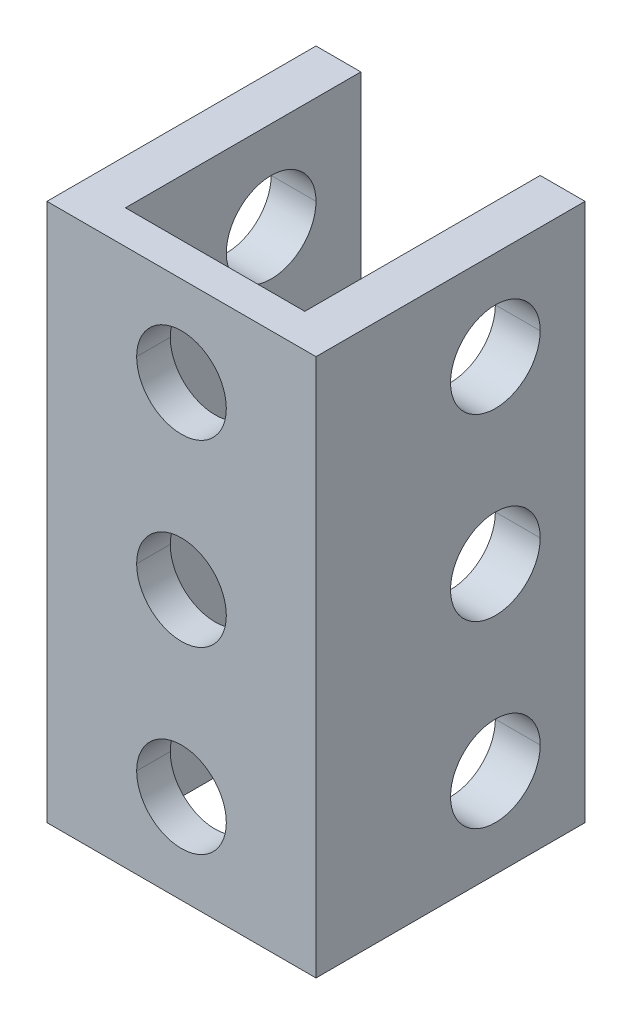
ISO-10303-21;
HEADER;
FILE_DESCRIPTION(('STEP AP214'),'2;1');
FILE_NAME('part.step','',(''),(''),'','','');
FILE_SCHEMA(('AUTOMOTIVE_DESIGN { 1 0 10303 214 1 1 1 1 }'));
ENDSEC;
DATA;
#1=APPLICATION_CONTEXT('core data for automotive mechanical design processes');
#2=APPLICATION_PROTOCOL_DEFINITION('international standard','automotive_design',2000,#1);
#3=PRODUCT_CONTEXT('',#1,'mechanical');
#4=PRODUCT('Part','Part','',(#3));
#5=PRODUCT_RELATED_PRODUCT_CATEGORY('part','',(#4));
#6=PRODUCT_DEFINITION_FORMATION('','',#4);
#7=PRODUCT_DEFINITION_CONTEXT('part definition',#1,'design');
#8=PRODUCT_DEFINITION('design','',#6,#7);
#9=PRODUCT_DEFINITION_SHAPE('','',#8);
#10=(LENGTH_UNIT() NAMED_UNIT(*) SI_UNIT(.MILLI.,.METRE.));
#11=(NAMED_UNIT(*) PLANE_ANGLE_UNIT() SI_UNIT($,.RADIAN.));
#12=(NAMED_UNIT(*) SI_UNIT($,.STERADIAN.) SOLID_ANGLE_UNIT());
#13=UNCERTAINTY_MEASURE_WITH_UNIT(LENGTH_MEASURE(1.E-05),#10,'distance_accuracy_value','');
#14=(GEOMETRIC_REPRESENTATION_CONTEXT(3) GLOBAL_UNCERTAINTY_ASSIGNED_CONTEXT((#13)) GLOBAL_UNIT_ASSIGNED_CONTEXT((#10,
#11,#12)) REPRESENTATION_CONTEXT('',''));
#15=CARTESIAN_POINT('',(0.,0.,0.));
#16=DIRECTION('',(0.,0.,1.));
#17=DIRECTION('',(1.,0.,0.));
#18=AXIS2_PLACEMENT_3D('',#15,#16,#17);
#19=CARTESIAN_POINT('',(0.,20.,1.5));
#20=DIRECTION('',(0.,0.,1.));
#21=DIRECTION('',(1.,0.,0.));
#22=AXIS2_PLACEMENT_3D('',#19,#20,#21);
#23=CYLINDRICAL_SURFACE('',#22,2.);
#24=DIRECTION('',(0.,0.,1.));
#25=VECTOR('',#24,1.);
#26=CARTESIAN_POINT('',(-2.,20.,1.5));
#27=LINE('',#26,#25);
#28=CARTESIAN_POINT('',(-2.,20.,0.));
#29=VERTEX_POINT('',#28);
#30=CARTESIAN_POINT('',(-2.,20.,1.5));
#31=VERTEX_POINT('',#30);
#32=EDGE_CURVE('E337',#29,#31,#27,.T.);
#33=ORIENTED_EDGE('',*,*,#32,.F.);
#34=CARTESIAN_POINT('',(0.,20.,0.));
#35=DIRECTION('',(0.,0.,1.));
#36=DIRECTION('',(1.,0.,0.));
#37=AXIS2_PLACEMENT_3D('',#34,#35,#36);
#38=CIRCLE('',#37,2.);
#39=CARTESIAN_POINT('',(2.,20.,0.));
#40=VERTEX_POINT('',#39);
#41=EDGE_CURVE('E310',#40,#29,#38,.T.);
#42=ORIENTED_EDGE('',*,*,#41,.F.);
#43=DIRECTION('',(0.,0.,1.));
#44=VECTOR('',#43,1.);
#45=CARTESIAN_POINT('',(2.,20.,1.5));
#46=LINE('',#45,#44);
#47=CARTESIAN_POINT('',(2.,20.,1.5));
#48=VERTEX_POINT('',#47);
#49=EDGE_CURVE('E336',#40,#48,#46,.T.);
#50=ORIENTED_EDGE('',*,*,#49,.T.);
#51=CARTESIAN_POINT('',(0.,20.,1.5));
#52=DIRECTION('',(0.,0.,1.));
#53=DIRECTION('',(1.,0.,0.));
#54=AXIS2_PLACEMENT_3D('',#51,#52,#53);
#55=CIRCLE('',#54,2.);
#56=EDGE_CURVE('E350',#48,#31,#55,.T.);
#57=ORIENTED_EDGE('',*,*,#56,.T.);
#58=EDGE_LOOP('',(#33,#42,#50,#57));
#59=FACE_BOUND('',#58,.T.);
#60=ADVANCED_FACE('F15',(#59),#23,.F.);
#61=CARTESIAN_POINT('',(0.,12.,1.5));
#62=DIRECTION('',(0.,0.,1.));
#63=DIRECTION('',(1.,0.,0.));
#64=AXIS2_PLACEMENT_3D('',#61,#62,#63);
#65=CYLINDRICAL_SURFACE('',#64,2.);
#66=DIRECTION('',(0.,0.,1.));
#67=VECTOR('',#66,1.);
#68=CARTESIAN_POINT('',(-2.,12.,1.5));
#69=LINE('',#68,#67);
#70=CARTESIAN_POINT('',(-2.,12.,0.));
#71=VERTEX_POINT('',#70);
#72=CARTESIAN_POINT('',(-2.,12.,1.5));
#73=VERTEX_POINT('',#72);
#74=EDGE_CURVE('E454',#71,#73,#69,.T.);
#75=ORIENTED_EDGE('',*,*,#74,.F.);
#76=CARTESIAN_POINT('',(0.,12.,0.));
#77=DIRECTION('',(0.,0.,1.));
#78=DIRECTION('',(1.,0.,0.));
#79=AXIS2_PLACEMENT_3D('',#76,#77,#78);
#80=CIRCLE('',#79,2.);
#81=CARTESIAN_POINT('',(2.,12.,0.));
#82=VERTEX_POINT('',#81);
#83=EDGE_CURVE('E19',#82,#71,#80,.T.);
#84=ORIENTED_EDGE('',*,*,#83,.F.);
#85=DIRECTION('',(0.,0.,1.));
#86=VECTOR('',#85,1.);
#87=CARTESIAN_POINT('',(2.,12.,1.5));
#88=LINE('',#87,#86);
#89=CARTESIAN_POINT('',(2.,12.,1.5));
#90=VERTEX_POINT('',#89);
#91=EDGE_CURVE('E465',#82,#90,#88,.T.);
#92=ORIENTED_EDGE('',*,*,#91,.T.);
#93=CARTESIAN_POINT('',(0.,12.,1.5));
#94=DIRECTION('',(0.,0.,1.));
#95=DIRECTION('',(1.,0.,0.));
#96=AXIS2_PLACEMENT_3D('',#93,#94,#95);
#97=CIRCLE('',#96,2.);
#98=EDGE_CURVE('E246',#90,#73,#97,.T.);
#99=ORIENTED_EDGE('',*,*,#98,.T.);
#100=EDGE_LOOP('',(#75,#84,#92,#99));
#101=FACE_BOUND('',#100,.T.);
#102=ADVANCED_FACE('F569',(#101),#65,.F.);
#103=CARTESIAN_POINT('',(-6.,20.,-6.5));
#104=DIRECTION('',(-1.,0.,0.));
#105=DIRECTION('',(0.,0.,1.));
#106=AXIS2_PLACEMENT_3D('',#103,#104,#105);
#107=CYLINDRICAL_SURFACE('',#106,2.);
#108=DIRECTION('',(-1.,0.,0.));
#109=VECTOR('',#108,1.);
#110=CARTESIAN_POINT('',(-6.,20.,-8.5));
#111=LINE('',#110,#109);
#112=CARTESIAN_POINT('',(6.,20.,-8.5));
#113=VERTEX_POINT('',#112);
#114=CARTESIAN_POINT('',(4.,20.,-8.5));
#115=VERTEX_POINT('',#114);
#116=EDGE_CURVE('E455',#113,#115,#111,.T.);
#117=ORIENTED_EDGE('',*,*,#116,.F.);
#118=CARTESIAN_POINT('',(6.,20.,-6.5));
#119=DIRECTION('',(-1.,0.,0.));
#120=DIRECTION('',(0.,0.,1.));
#121=AXIS2_PLACEMENT_3D('',#118,#119,#120);
#122=CIRCLE('',#121,2.);
#123=CARTESIAN_POINT('',(6.,20.,-4.5));
#124=VERTEX_POINT('',#123);
#125=EDGE_CURVE('E281',#124,#113,#122,.T.);
#126=ORIENTED_EDGE('',*,*,#125,.F.);
#127=DIRECTION('',(-1.,0.,0.));
#128=VECTOR('',#127,1.);
#129=CARTESIAN_POINT('',(-6.,20.,-4.5));
#130=LINE('',#129,#128);
#131=CARTESIAN_POINT('',(4.,20.,-4.5));
#132=VERTEX_POINT('',#131);
#133=EDGE_CURVE('E317',#124,#132,#130,.T.);
#134=ORIENTED_EDGE('',*,*,#133,.T.);
#135=CARTESIAN_POINT('',(4.,20.,-6.5));
#136=DIRECTION('',(1.,0.,0.));
#137=DIRECTION('',(0.,0.,-1.));
#138=AXIS2_PLACEMENT_3D('',#135,#136,#137);
#139=CIRCLE('',#138,2.);
#140=EDGE_CURVE('E341',#115,#132,#139,.T.);
#141=ORIENTED_EDGE('',*,*,#140,.F.);
#142=EDGE_LOOP('',(#117,#126,#134,#141));
#143=FACE_BOUND('',#142,.T.);
#144=ADVANCED_FACE('F565',(#143),#107,.F.);
#145=CARTESIAN_POINT('',(-6.,12.,-6.5));
#146=DIRECTION('',(-1.,0.,0.));
#147=DIRECTION('',(0.,0.,1.));
#148=AXIS2_PLACEMENT_3D('',#145,#146,#147);
#149=CYLINDRICAL_SURFACE('',#148,2.);
#150=DIRECTION('',(-1.,0.,0.));
#151=VECTOR('',#150,1.);
#152=CARTESIAN_POINT('',(-6.,12.,-8.5));
#153=LINE('',#152,#151);
#154=CARTESIAN_POINT('',(6.,12.,-8.5));
#155=VERTEX_POINT('',#154);
#156=CARTESIAN_POINT('',(4.,12.,-8.5));
#157=VERTEX_POINT('',#156);
#158=EDGE_CURVE('E292',#155,#157,#153,.T.);
#159=ORIENTED_EDGE('',*,*,#158,.F.);
#160=CARTESIAN_POINT('',(6.,12.,-6.5));
#161=DIRECTION('',(-1.,0.,0.));
#162=DIRECTION('',(0.,0.,1.));
#163=AXIS2_PLACEMENT_3D('',#160,#161,#162);
#164=CIRCLE('',#163,2.);
#165=CARTESIAN_POINT('',(6.,12.,-4.5));
#166=VERTEX_POINT('',#165);
#167=EDGE_CURVE('E316',#166,#155,#164,.T.);
#168=ORIENTED_EDGE('',*,*,#167,.F.);
#169=DIRECTION('',(-1.,0.,0.));
#170=VECTOR('',#169,1.);
#171=CARTESIAN_POINT('',(-6.,12.,-4.5));
#172=LINE('',#171,#170);
#173=CARTESIAN_POINT('',(4.,12.,-4.5));
#174=VERTEX_POINT('',#173);
#175=EDGE_CURVE('E354',#166,#174,#172,.T.);
#176=ORIENTED_EDGE('',*,*,#175,.T.);
#177=CARTESIAN_POINT('',(4.,12.,-6.5));
#178=DIRECTION('',(1.,0.,0.));
#179=DIRECTION('',(0.,0.,-1.));
#180=AXIS2_PLACEMENT_3D('',#177,#178,#179);
#181=CIRCLE('',#180,2.);
#182=EDGE_CURVE('E342',#157,#174,#181,.T.);
#183=ORIENTED_EDGE('',*,*,#182,.F.);
#184=EDGE_LOOP('',(#159,#168,#176,#183));
#185=FACE_BOUND('',#184,.T.);
#186=ADVANCED_FACE('F557',(#185),#149,.F.);
#187=CARTESIAN_POINT('',(-6.,20.,-6.5));
#188=DIRECTION('',(-1.,0.,0.));
#189=DIRECTION('',(0.,0.,1.));
#190=AXIS2_PLACEMENT_3D('',#187,#188,#189);
#191=CYLINDRICAL_SURFACE('',#190,2.);
#192=DIRECTION('',(-1.,0.,0.));
#193=VECTOR('',#192,1.);
#194=CARTESIAN_POINT('',(-6.,20.,-8.5));
#195=LINE('',#194,#193);
#196=CARTESIAN_POINT('',(-4.,20.,-8.5));
#197=VERTEX_POINT('',#196);
#198=CARTESIAN_POINT('',(-6.,20.,-8.5));
#199=VERTEX_POINT('',#198);
#200=EDGE_CURVE('E298',#197,#199,#195,.T.);
#201=ORIENTED_EDGE('',*,*,#200,.F.);
#202=CARTESIAN_POINT('',(-4.,20.,-6.5));
#203=DIRECTION('',(-1.,0.,0.));
#204=DIRECTION('',(0.,0.,1.));
#205=AXIS2_PLACEMENT_3D('',#202,#203,#204);
#206=CIRCLE('',#205,2.);
#207=CARTESIAN_POINT('',(-4.,20.,-4.5));
#208=VERTEX_POINT('',#207);
#209=EDGE_CURVE('E272',#208,#197,#206,.T.);
#210=ORIENTED_EDGE('',*,*,#209,.F.);
#211=DIRECTION('',(-1.,0.,0.));
#212=VECTOR('',#211,1.);
#213=CARTESIAN_POINT('',(-6.,20.,-4.5));
#214=LINE('',#213,#212);
#215=CARTESIAN_POINT('',(-6.,20.,-4.5));
#216=VERTEX_POINT('',#215);
#217=EDGE_CURVE('E343',#208,#216,#214,.T.);
#218=ORIENTED_EDGE('',*,*,#217,.T.);
#219=CARTESIAN_POINT('',(-6.,20.,-6.5));
#220=DIRECTION('',(-1.,0.,0.));
#221=DIRECTION('',(0.,0.,1.));
#222=AXIS2_PLACEMENT_3D('',#219,#220,#221);
#223=CIRCLE('',#222,2.);
#224=EDGE_CURVE('E384',#216,#199,#223,.T.);
#225=ORIENTED_EDGE('',*,*,#224,.T.);
#226=EDGE_LOOP('',(#201,#210,#218,#225));
#227=FACE_BOUND('',#226,.T.);
#228=ADVANCED_FACE('F17',(#227),#191,.F.);
#229=CARTESIAN_POINT('',(-6.,12.,-6.5));
#230=DIRECTION('',(-1.,0.,0.));
#231=DIRECTION('',(0.,0.,1.));
#232=AXIS2_PLACEMENT_3D('',#229,#230,#231);
#233=CYLINDRICAL_SURFACE('',#232,2.);
#234=DIRECTION('',(-1.,0.,0.));
#235=VECTOR('',#234,1.);
#236=CARTESIAN_POINT('',(-6.,12.,-8.5));
#237=LINE('',#236,#235);
#238=CARTESIAN_POINT('',(-4.,12.,-8.5));
#239=VERTEX_POINT('',#238);
#240=CARTESIAN_POINT('',(-6.,12.,-8.5));
#241=VERTEX_POINT('',#240);
#242=EDGE_CURVE('E363',#239,#241,#237,.T.);
#243=ORIENTED_EDGE('',*,*,#242,.F.);
#244=CARTESIAN_POINT('',(-4.,12.,-6.5));
#245=DIRECTION('',(-1.,0.,0.));
#246=DIRECTION('',(0.,0.,1.));
#247=AXIS2_PLACEMENT_3D('',#244,#245,#246);
#248=CIRCLE('',#247,2.);
#249=CARTESIAN_POINT('',(-4.,12.,-4.5));
#250=VERTEX_POINT('',#249);
#251=EDGE_CURVE('E208',#250,#239,#248,.T.);
#252=ORIENTED_EDGE('',*,*,#251,.F.);
#253=DIRECTION('',(-1.,0.,0.));
#254=VECTOR('',#253,1.);
#255=CARTESIAN_POINT('',(-6.,12.,-4.5));
#256=LINE('',#255,#254);
#257=CARTESIAN_POINT('',(-6.,12.,-4.5));
#258=VERTEX_POINT('',#257);
#259=EDGE_CURVE('E324',#250,#258,#256,.T.);
#260=ORIENTED_EDGE('',*,*,#259,.T.);
#261=CARTESIAN_POINT('',(-6.,12.,-6.5));
#262=DIRECTION('',(-1.,0.,0.));
#263=DIRECTION('',(0.,0.,1.));
#264=AXIS2_PLACEMENT_3D('',#261,#262,#263);
#265=CIRCLE('',#264,2.);
#266=EDGE_CURVE('E217',#258,#241,#265,.T.);
#267=ORIENTED_EDGE('',*,*,#266,.T.);
#268=EDGE_LOOP('',(#243,#252,#260,#267));
#269=FACE_BOUND('',#268,.T.);
#270=ADVANCED_FACE('F556',(#269),#233,.F.);
#271=CARTESIAN_POINT('',(0.,24.,0.));
#272=DIRECTION('',(0.,1.,0.));
#273=DIRECTION('',(1.,0.,0.));
#274=AXIS2_PLACEMENT_3D('',#271,#272,#273);
#275=PLANE('',#274);
#276=DIRECTION('',(0.,0.,-1.));
#277=VECTOR('',#276,1.);
#278=CARTESIAN_POINT('',(-4.,24.,0.));
#279=LINE('',#278,#277);
#280=CARTESIAN_POINT('',(-4.,24.,0.));
#281=VERTEX_POINT('',#280);
#282=CARTESIAN_POINT('',(-4.,24.,-10.5));
#283=VERTEX_POINT('',#282);
#284=EDGE_CURVE('E286',#281,#283,#279,.T.);
#285=ORIENTED_EDGE('',*,*,#284,.T.);
#286=DIRECTION('',(-1.,0.,0.));
#287=VECTOR('',#286,1.);
#288=CARTESIAN_POINT('',(-4.,24.,-10.5));
#289=LINE('',#288,#287);
#290=CARTESIAN_POINT('',(-6.,24.,-10.5));
#291=VERTEX_POINT('',#290);
#292=EDGE_CURVE('E409',#283,#291,#289,.T.);
#293=ORIENTED_EDGE('',*,*,#292,.T.);
#294=DIRECTION('',(0.,0.,1.));
#295=VECTOR('',#294,1.);
#296=CARTESIAN_POINT('',(-6.,24.,-10.5));
#297=LINE('',#296,#295);
#298=CARTESIAN_POINT('',(-6.,24.,1.5));
#299=VERTEX_POINT('',#298);
#300=EDGE_CURVE('E420',#291,#299,#297,.T.);
#301=ORIENTED_EDGE('',*,*,#300,.T.);
#302=DIRECTION('',(1.,0.,0.));
#303=VECTOR('',#302,1.);
#304=CARTESIAN_POINT('',(-6.,24.,1.5));
#305=LINE('',#304,#303);
#306=CARTESIAN_POINT('',(6.,24.,1.5));
#307=VERTEX_POINT('',#306);
#308=EDGE_CURVE('E393',#299,#307,#305,.T.);
#309=ORIENTED_EDGE('',*,*,#308,.T.);
#310=DIRECTION('',(0.,0.,-1.));
#311=VECTOR('',#310,1.);
#312=CARTESIAN_POINT('',(6.,24.,-10.5));
#313=LINE('',#312,#311);
#314=CARTESIAN_POINT('',(6.,24.,-10.5));
#315=VERTEX_POINT('',#314);
#316=EDGE_CURVE('E325',#307,#315,#313,.T.);
#317=ORIENTED_EDGE('',*,*,#316,.T.);
#318=DIRECTION('',(-1.,0.,0.));
#319=VECTOR('',#318,1.);
#320=CARTESIAN_POINT('',(4.,24.,-10.5));
#321=LINE('',#320,#319);
#322=CARTESIAN_POINT('',(4.,24.,-10.5));
#323=VERTEX_POINT('',#322);
#324=EDGE_CURVE('E428',#315,#323,#321,.T.);
#325=ORIENTED_EDGE('',*,*,#324,.T.);
#326=DIRECTION('',(0.,0.,1.));
#327=VECTOR('',#326,1.);
#328=CARTESIAN_POINT('',(4.,24.,0.));
#329=LINE('',#328,#327);
#330=CARTESIAN_POINT('',(4.,24.,0.));
#331=VERTEX_POINT('',#330);
#332=EDGE_CURVE('E374',#323,#331,#329,.T.);
#333=ORIENTED_EDGE('',*,*,#332,.T.);
#334=DIRECTION('',(-1.,0.,0.));
#335=VECTOR('',#334,1.);
#336=CARTESIAN_POINT('',(4.,24.,0.));
#337=LINE('',#336,#335);
#338=EDGE_CURVE('E40',#331,#281,#337,.T.);
#339=ORIENTED_EDGE('',*,*,#338,.T.);
#340=EDGE_LOOP('',(#285,#293,#301,#309,#317,#325,#333,#339));
#341=FACE_BOUND('',#340,.T.);
#342=ADVANCED_FACE('F563',(#341),#275,.T.);
#343=CARTESIAN_POINT('',(0.,4.,1.5));
#344=DIRECTION('',(0.,0.,1.));
#345=DIRECTION('',(1.,0.,0.));
#346=AXIS2_PLACEMENT_3D('',#343,#344,#345);
#347=CYLINDRICAL_SURFACE('',#346,2.);
#348=DIRECTION('',(0.,0.,1.));
#349=VECTOR('',#348,1.);
#350=CARTESIAN_POINT('',(-2.,4.,1.5));
#351=LINE('',#350,#349);
#352=CARTESIAN_POINT('',(-2.,4.,0.));
#353=VERTEX_POINT('',#352);
#354=CARTESIAN_POINT('',(-2.,4.,1.5));
#355=VERTEX_POINT('',#354);
#356=EDGE_CURVE('E258',#353,#355,#351,.T.);
#357=ORIENTED_EDGE('',*,*,#356,.F.);
#358=CARTESIAN_POINT('',(0.,4.,0.));
#359=DIRECTION('',(0.,0.,1.));
#360=DIRECTION('',(1.,0.,0.));
#361=AXIS2_PLACEMENT_3D('',#358,#359,#360);
#362=CIRCLE('',#361,2.);
#363=CARTESIAN_POINT('',(2.,4.,0.));
#364=VERTEX_POINT('',#363);
#365=EDGE_CURVE('E10',#364,#353,#362,.T.);
#366=ORIENTED_EDGE('',*,*,#365,.F.);
#367=DIRECTION('',(0.,0.,1.));
#368=VECTOR('',#367,1.);
#369=CARTESIAN_POINT('',(2.,4.,1.5));
#370=LINE('',#369,#368);
#371=CARTESIAN_POINT('',(2.,4.,1.5));
#372=VERTEX_POINT('',#371);
#373=EDGE_CURVE('E249',#364,#372,#370,.T.);
#374=ORIENTED_EDGE('',*,*,#373,.T.);
#375=CARTESIAN_POINT('',(0.,4.,1.5));
#376=DIRECTION('',(0.,0.,1.));
#377=DIRECTION('',(1.,0.,0.));
#378=AXIS2_PLACEMENT_3D('',#375,#376,#377);
#379=CIRCLE('',#378,2.);
#380=EDGE_CURVE('E235',#372,#355,#379,.T.);
#381=ORIENTED_EDGE('',*,*,#380,.T.);
#382=EDGE_LOOP('',(#357,#366,#374,#381));
#383=FACE_BOUND('',#382,.T.);
#384=ADVANCED_FACE('F250',(#383),#347,.F.);
#385=CARTESIAN_POINT('',(-6.,4.,-6.5));
#386=DIRECTION('',(-1.,0.,0.));
#387=DIRECTION('',(0.,0.,1.));
#388=AXIS2_PLACEMENT_3D('',#385,#386,#387);
#389=CYLINDRICAL_SURFACE('',#388,2.);
#390=DIRECTION('',(-1.,0.,0.));
#391=VECTOR('',#390,1.);
#392=CARTESIAN_POINT('',(-6.,4.,-8.5));
#393=LINE('',#392,#391);
#394=CARTESIAN_POINT('',(-4.,4.,-8.5));
#395=VERTEX_POINT('',#394);
#396=CARTESIAN_POINT('',(-6.,4.,-8.5));
#397=VERTEX_POINT('',#396);
#398=EDGE_CURVE('E359',#395,#397,#393,.T.);
#399=ORIENTED_EDGE('',*,*,#398,.F.);
#400=CARTESIAN_POINT('',(-4.,4.,-6.5));
#401=DIRECTION('',(-1.,0.,0.));
#402=DIRECTION('',(0.,0.,1.));
#403=AXIS2_PLACEMENT_3D('',#400,#401,#402);
#404=CIRCLE('',#403,2.);
#405=CARTESIAN_POINT('',(-4.,4.,-4.5));
#406=VERTEX_POINT('',#405);
#407=EDGE_CURVE('E275',#406,#395,#404,.T.);
#408=ORIENTED_EDGE('',*,*,#407,.F.);
#409=DIRECTION('',(-1.,0.,0.));
#410=VECTOR('',#409,1.);
#411=CARTESIAN_POINT('',(-6.,4.,-4.5));
#412=LINE('',#411,#410);
#413=CARTESIAN_POINT('',(-6.,4.,-4.5));
#414=VERTEX_POINT('',#413);
#415=EDGE_CURVE('E309',#406,#414,#412,.T.);
#416=ORIENTED_EDGE('',*,*,#415,.T.);
#417=CARTESIAN_POINT('',(-6.,4.,-6.5));
#418=DIRECTION('',(-1.,0.,0.));
#419=DIRECTION('',(0.,0.,1.));
#420=AXIS2_PLACEMENT_3D('',#417,#418,#419);
#421=CIRCLE('',#420,2.);
#422=EDGE_CURVE('E396',#414,#397,#421,.T.);
#423=ORIENTED_EDGE('',*,*,#422,.T.);
#424=EDGE_LOOP('',(#399,#408,#416,#423));
#425=FACE_BOUND('',#424,.T.);
#426=ADVANCED_FACE('F792',(#425),#389,.F.);
#427=CARTESIAN_POINT('',(-6.,4.,-6.5));
#428=DIRECTION('',(-1.,0.,0.));
#429=DIRECTION('',(0.,0.,1.));
#430=AXIS2_PLACEMENT_3D('',#427,#428,#429);
#431=CYLINDRICAL_SURFACE('',#430,2.);
#432=DIRECTION('',(-1.,0.,0.));
#433=VECTOR('',#432,1.);
#434=CARTESIAN_POINT('',(-6.,4.,-8.5));
#435=LINE('',#434,#433);
#436=CARTESIAN_POINT('',(6.,4.,-8.5));
#437=VERTEX_POINT('',#436);
#438=CARTESIAN_POINT('',(4.,4.,-8.5));
#439=VERTEX_POINT('',#438);
#440=EDGE_CURVE('E308',#437,#439,#435,.T.);
#441=ORIENTED_EDGE('',*,*,#440,.F.);
#442=CARTESIAN_POINT('',(6.,4.,-6.5));
#443=DIRECTION('',(-1.,0.,0.));
#444=DIRECTION('',(0.,0.,1.));
#445=AXIS2_PLACEMENT_3D('',#442,#443,#444);
#446=CIRCLE('',#445,2.);
#447=CARTESIAN_POINT('',(6.,4.,-4.5));
#448=VERTEX_POINT('',#447);
#449=EDGE_CURVE('E313',#448,#437,#446,.T.);
#450=ORIENTED_EDGE('',*,*,#449,.F.);
#451=DIRECTION('',(-1.,0.,0.));
#452=VECTOR('',#451,1.);
#453=CARTESIAN_POINT('',(-6.,4.,-4.5));
#454=LINE('',#453,#452);
#455=CARTESIAN_POINT('',(4.,4.,-4.5));
#456=VERTEX_POINT('',#455);
#457=EDGE_CURVE('E270',#448,#456,#454,.T.);
#458=ORIENTED_EDGE('',*,*,#457,.T.);
#459=CARTESIAN_POINT('',(4.,4.,-6.5));
#460=DIRECTION('',(1.,0.,0.));
#461=DIRECTION('',(0.,0.,-1.));
#462=AXIS2_PLACEMENT_3D('',#459,#460,#461);
#463=CIRCLE('',#462,2.);
#464=EDGE_CURVE('E338',#439,#456,#463,.T.);
#465=ORIENTED_EDGE('',*,*,#464,.F.);
#466=EDGE_LOOP('',(#441,#450,#458,#465));
#467=FACE_BOUND('',#466,.T.);
#468=ADVANCED_FACE('F796',(#467),#431,.F.);
#469=CARTESIAN_POINT('',(0.,0.,0.));
#470=DIRECTION('',(0.,1.,0.));
#471=DIRECTION('',(1.,0.,0.));
#472=AXIS2_PLACEMENT_3D('',#469,#470,#471);
#473=PLANE('',#472);
#474=DIRECTION('',(0.,0.,-1.));
#475=VECTOR('',#474,1.);
#476=CARTESIAN_POINT('',(-4.,0.,0.));
#477=LINE('',#476,#475);
#478=CARTESIAN_POINT('',(-4.,0.,0.));
#479=VERTEX_POINT('',#478);
#480=CARTESIAN_POINT('',(-4.,0.,-10.5));
#481=VERTEX_POINT('',#480);
#482=EDGE_CURVE('E287',#479,#481,#477,.T.);
#483=ORIENTED_EDGE('',*,*,#482,.F.);
#484=DIRECTION('',(-1.,0.,0.));
#485=VECTOR('',#484,1.);
#486=CARTESIAN_POINT('',(4.,0.,0.));
#487=LINE('',#486,#485);
#488=CARTESIAN_POINT('',(4.,0.,0.));
#489=VERTEX_POINT('',#488);
#490=EDGE_CURVE('E416',#489,#479,#487,.T.);
#491=ORIENTED_EDGE('',*,*,#490,.F.);
#492=DIRECTION('',(0.,0.,1.));
#493=VECTOR('',#492,1.);
#494=CARTESIAN_POINT('',(4.,0.,0.));
#495=LINE('',#494,#493);
#496=CARTESIAN_POINT('',(4.,0.,-10.5));
#497=VERTEX_POINT('',#496);
#498=EDGE_CURVE('E422',#497,#489,#495,.T.);
#499=ORIENTED_EDGE('',*,*,#498,.F.);
#500=DIRECTION('',(-1.,0.,0.));
#501=VECTOR('',#500,1.);
#502=CARTESIAN_POINT('',(4.,0.,-10.5));
#503=LINE('',#502,#501);
#504=CARTESIAN_POINT('',(6.,0.,-10.5));
#505=VERTEX_POINT('',#504);
#506=EDGE_CURVE('E276',#505,#497,#503,.T.);
#507=ORIENTED_EDGE('',*,*,#506,.F.);
#508=DIRECTION('',(0.,0.,-1.));
#509=VECTOR('',#508,1.);
#510=CARTESIAN_POINT('',(6.,0.,-10.5));
#511=LINE('',#510,#509);
#512=CARTESIAN_POINT('',(6.,0.,1.5));
#513=VERTEX_POINT('',#512);
#514=EDGE_CURVE('E245',#513,#505,#511,.T.);
#515=ORIENTED_EDGE('',*,*,#514,.F.);
#516=DIRECTION('',(1.,0.,0.));
#517=VECTOR('',#516,1.);
#518=CARTESIAN_POINT('',(-6.,0.,1.5));
#519=LINE('',#518,#517);
#520=CARTESIAN_POINT('',(-6.,0.,1.5));
#521=VERTEX_POINT('',#520);
#522=EDGE_CURVE('E380',#521,#513,#519,.T.);
#523=ORIENTED_EDGE('',*,*,#522,.F.);
#524=DIRECTION('',(0.,0.,1.));
#525=VECTOR('',#524,1.);
#526=CARTESIAN_POINT('',(-6.,0.,-10.5));
#527=LINE('',#526,#525);
#528=CARTESIAN_POINT('',(-6.,0.,-10.5));
#529=VERTEX_POINT('',#528);
#530=EDGE_CURVE('E441',#529,#521,#527,.T.);
#531=ORIENTED_EDGE('',*,*,#530,.F.);
#532=DIRECTION('',(-1.,0.,0.));
#533=VECTOR('',#532,1.);
#534=CARTESIAN_POINT('',(-4.,0.,-10.5));
#535=LINE('',#534,#533);
#536=EDGE_CURVE('E274',#481,#529,#535,.T.);
#537=ORIENTED_EDGE('',*,*,#536,.F.);
#538=EDGE_LOOP('',(#483,#491,#499,#507,#515,#523,#531,#537));
#539=FACE_BOUND('',#538,.T.);
#540=ADVANCED_FACE('F592',(#539),#473,.F.);
#541=CARTESIAN_POINT('',(4.,8.,0.));
#542=DIRECTION('',(0.,0.,1.));
#543=DIRECTION('',(1.,0.,0.));
#544=AXIS2_PLACEMENT_3D('',#541,#542,#543);
#545=PLANE('',#544);
#546=ORIENTED_EDGE('',*,*,#365,.T.);
#547=CARTESIAN_POINT('',(0.,4.,0.));
#548=DIRECTION('',(0.,0.,1.));
#549=DIRECTION('',(1.,0.,0.));
#550=AXIS2_PLACEMENT_3D('',#547,#548,#549);
#551=CIRCLE('',#550,2.);
#552=EDGE_CURVE('E266',#353,#364,#551,.T.);
#553=ORIENTED_EDGE('',*,*,#552,.T.);
#554=EDGE_LOOP('',(#546,#553));
#555=FACE_BOUND('',#554,.T.);
#556=ORIENTED_EDGE('',*,*,#83,.T.);
#557=CARTESIAN_POINT('',(0.,12.,0.));
#558=DIRECTION('',(0.,0.,1.));
#559=DIRECTION('',(1.,0.,0.));
#560=AXIS2_PLACEMENT_3D('',#557,#558,#559);
#561=CIRCLE('',#560,2.);
#562=EDGE_CURVE('E450',#71,#82,#561,.T.);
#563=ORIENTED_EDGE('',*,*,#562,.T.);
#564=EDGE_LOOP('',(#556,#563));
#565=FACE_BOUND('',#564,.T.);
#566=ORIENTED_EDGE('',*,*,#41,.T.);
#567=CARTESIAN_POINT('',(0.,20.,0.));
#568=DIRECTION('',(0.,0.,1.));
#569=DIRECTION('',(1.,0.,0.));
#570=AXIS2_PLACEMENT_3D('',#567,#568,#569);
#571=CIRCLE('',#570,2.);
#572=EDGE_CURVE('E504',#29,#40,#571,.T.);
#573=ORIENTED_EDGE('',*,*,#572,.T.);
#574=EDGE_LOOP('',(#566,#573));
#575=FACE_BOUND('',#574,.T.);
#576=ORIENTED_EDGE('',*,*,#490,.T.);
#577=DIRECTION('',(0.,-1.,0.));
#578=VECTOR('',#577,1.);
#579=CARTESIAN_POINT('',(-4.,8.,0.));
#580=LINE('',#579,#578);
#581=EDGE_CURVE('E370',#281,#479,#580,.T.);
#582=ORIENTED_EDGE('',*,*,#581,.F.);
#583=ORIENTED_EDGE('',*,*,#338,.F.);
#584=DIRECTION('',(0.,-1.,0.));
#585=VECTOR('',#584,1.);
#586=CARTESIAN_POINT('',(4.,8.,0.));
#587=LINE('',#586,#585);
#588=EDGE_CURVE('E377',#331,#489,#587,.T.);
#589=ORIENTED_EDGE('',*,*,#588,.T.);
#590=EDGE_LOOP('',(#576,#582,#583,#589));
#591=FACE_BOUND('',#590,.T.);
#592=ADVANCED_FACE('F588',(#555,#565,#575,#591),#545,.F.);
#593=CARTESIAN_POINT('',(4.,8.,0.));
#594=DIRECTION('',(1.,0.,0.));
#595=DIRECTION('',(0.,1.,0.));
#596=AXIS2_PLACEMENT_3D('',#593,#594,#595);
#597=PLANE('',#596);
#598=CARTESIAN_POINT('',(4.,20.,-6.5));
#599=DIRECTION('',(1.,0.,0.));
#600=DIRECTION('',(0.,0.,-1.));
#601=AXIS2_PLACEMENT_3D('',#598,#599,#600);
#602=CIRCLE('',#601,2.);
#603=EDGE_CURVE('E321',#132,#115,#602,.T.);
#604=ORIENTED_EDGE('',*,*,#603,.T.);
#605=ORIENTED_EDGE('',*,*,#140,.T.);
#606=EDGE_LOOP('',(#604,#605));
#607=FACE_BOUND('',#606,.T.);
#608=CARTESIAN_POINT('',(4.,4.,-6.5));
#609=DIRECTION('',(1.,0.,0.));
#610=DIRECTION('',(0.,0.,-1.));
#611=AXIS2_PLACEMENT_3D('',#608,#609,#610);
#612=CIRCLE('',#611,2.);
#613=EDGE_CURVE('E482',#456,#439,#612,.T.);
#614=ORIENTED_EDGE('',*,*,#613,.T.);
#615=ORIENTED_EDGE('',*,*,#464,.T.);
#616=EDGE_LOOP('',(#614,#615));
#617=FACE_BOUND('',#616,.T.);
#618=CARTESIAN_POINT('',(4.,12.,-6.5));
#619=DIRECTION('',(1.,0.,0.));
#620=DIRECTION('',(0.,0.,-1.));
#621=AXIS2_PLACEMENT_3D('',#618,#619,#620);
#622=CIRCLE('',#621,2.);
#623=EDGE_CURVE('E296',#174,#157,#622,.T.);
#624=ORIENTED_EDGE('',*,*,#623,.T.);
#625=ORIENTED_EDGE('',*,*,#182,.T.);
#626=EDGE_LOOP('',(#624,#625));
#627=FACE_BOUND('',#626,.T.);
#628=ORIENTED_EDGE('',*,*,#498,.T.);
#629=ORIENTED_EDGE('',*,*,#588,.F.);
#630=ORIENTED_EDGE('',*,*,#332,.F.);
#631=DIRECTION('',(0.,-1.,0.));
#632=VECTOR('',#631,1.);
#633=CARTESIAN_POINT('',(4.,8.,-10.5));
#634=LINE('',#633,#632);
#635=EDGE_CURVE('E280',#323,#497,#634,.T.);
#636=ORIENTED_EDGE('',*,*,#635,.T.);
#637=EDGE_LOOP('',(#628,#629,#630,#636));
#638=FACE_BOUND('',#637,.T.);
#639=ADVANCED_FACE('F591',(#607,#617,#627,#638),#597,.F.);
#640=CARTESIAN_POINT('',(4.,8.,-10.5));
#641=DIRECTION('',(0.,0.,1.));
#642=DIRECTION('',(1.,0.,0.));
#643=AXIS2_PLACEMENT_3D('',#640,#641,#642);
#644=PLANE('',#643);
#645=ORIENTED_EDGE('',*,*,#506,.T.);
#646=ORIENTED_EDGE('',*,*,#635,.F.);
#647=ORIENTED_EDGE('',*,*,#324,.F.);
#648=DIRECTION('',(0.,-1.,0.));
#649=VECTOR('',#648,1.);
#650=CARTESIAN_POINT('',(6.,8.,-10.5));
#651=LINE('',#650,#649);
#652=EDGE_CURVE('E329',#315,#505,#651,.T.);
#653=ORIENTED_EDGE('',*,*,#652,.T.);
#654=EDGE_LOOP('',(#645,#646,#647,#653));
#655=FACE_BOUND('',#654,.T.);
#656=ADVANCED_FACE('F611',(#655),#644,.F.);
#657=CARTESIAN_POINT('',(6.,8.,-10.5));
#658=DIRECTION('',(-1.,0.,0.));
#659=DIRECTION('',(0.,0.,1.));
#660=AXIS2_PLACEMENT_3D('',#657,#658,#659);
#661=PLANE('',#660);
#662=ORIENTED_EDGE('',*,*,#125,.T.);
#663=CARTESIAN_POINT('',(6.,20.,-6.5));
#664=DIRECTION('',(-1.,0.,0.));
#665=DIRECTION('',(0.,0.,1.));
#666=AXIS2_PLACEMENT_3D('',#663,#664,#665);
#667=CIRCLE('',#666,2.);
#668=EDGE_CURVE('E459',#113,#124,#667,.T.);
#669=ORIENTED_EDGE('',*,*,#668,.T.);
#670=EDGE_LOOP('',(#662,#669));
#671=FACE_BOUND('',#670,.T.);
#672=ORIENTED_EDGE('',*,*,#449,.T.);
#673=CARTESIAN_POINT('',(6.,4.,-6.5));
#674=DIRECTION('',(-1.,0.,0.));
#675=DIRECTION('',(0.,0.,1.));
#676=AXIS2_PLACEMENT_3D('',#673,#674,#675);
#677=CIRCLE('',#676,2.);
#678=EDGE_CURVE('E304',#437,#448,#677,.T.);
#679=ORIENTED_EDGE('',*,*,#678,.T.);
#680=EDGE_LOOP('',(#672,#679));
#681=FACE_BOUND('',#680,.T.);
#682=ORIENTED_EDGE('',*,*,#167,.T.);
#683=CARTESIAN_POINT('',(6.,12.,-6.5));
#684=DIRECTION('',(-1.,0.,0.));
#685=DIRECTION('',(0.,0.,1.));
#686=AXIS2_PLACEMENT_3D('',#683,#684,#685);
#687=CIRCLE('',#686,2.);
#688=EDGE_CURVE('E297',#155,#166,#687,.T.);
#689=ORIENTED_EDGE('',*,*,#688,.T.);
#690=EDGE_LOOP('',(#682,#689));
#691=FACE_BOUND('',#690,.T.);
#692=ORIENTED_EDGE('',*,*,#514,.T.);
#693=ORIENTED_EDGE('',*,*,#652,.F.);
#694=ORIENTED_EDGE('',*,*,#316,.F.);
#695=DIRECTION('',(0.,-1.,0.));
#696=VECTOR('',#695,1.);
#697=CARTESIAN_POINT('',(6.,8.,1.5));
#698=LINE('',#697,#696);
#699=EDGE_CURVE('E383',#307,#513,#698,.T.);
#700=ORIENTED_EDGE('',*,*,#699,.T.);
#701=EDGE_LOOP('',(#692,#693,#694,#700));
#702=FACE_BOUND('',#701,.T.);
#703=ADVANCED_FACE('F614',(#671,#681,#691,#702),#661,.F.);
#704=CARTESIAN_POINT('',(-6.,8.,1.5));
#705=DIRECTION('',(0.,0.,-1.));
#706=DIRECTION('',(0.,-1.,0.));
#707=AXIS2_PLACEMENT_3D('',#704,#705,#706);
#708=PLANE('',#707);
#709=ORIENTED_EDGE('',*,*,#380,.F.);
#710=CARTESIAN_POINT('',(0.,4.,1.5));
#711=DIRECTION('',(0.,0.,1.));
#712=DIRECTION('',(1.,0.,0.));
#713=AXIS2_PLACEMENT_3D('',#710,#711,#712);
#714=CIRCLE('',#713,2.);
#715=EDGE_CURVE('E240',#355,#372,#714,.T.);
#716=ORIENTED_EDGE('',*,*,#715,.F.);
#717=EDGE_LOOP('',(#709,#716));
#718=FACE_BOUND('',#717,.T.);
#719=ORIENTED_EDGE('',*,*,#98,.F.);
#720=CARTESIAN_POINT('',(0.,12.,1.5));
#721=DIRECTION('',(0.,0.,1.));
#722=DIRECTION('',(1.,0.,0.));
#723=AXIS2_PLACEMENT_3D('',#720,#721,#722);
#724=CIRCLE('',#723,2.);
#725=EDGE_CURVE('E472',#73,#90,#724,.T.);
#726=ORIENTED_EDGE('',*,*,#725,.F.);
#727=EDGE_LOOP('',(#719,#726));
#728=FACE_BOUND('',#727,.T.);
#729=ORIENTED_EDGE('',*,*,#56,.F.);
#730=CARTESIAN_POINT('',(0.,20.,1.5));
#731=DIRECTION('',(0.,0.,1.));
#732=DIRECTION('',(1.,0.,0.));
#733=AXIS2_PLACEMENT_3D('',#730,#731,#732);
#734=CIRCLE('',#733,2.);
#735=EDGE_CURVE('E332',#31,#48,#734,.T.);
#736=ORIENTED_EDGE('',*,*,#735,.F.);
#737=EDGE_LOOP('',(#729,#736));
#738=FACE_BOUND('',#737,.T.);
#739=ORIENTED_EDGE('',*,*,#522,.T.);
#740=ORIENTED_EDGE('',*,*,#699,.F.);
#741=ORIENTED_EDGE('',*,*,#308,.F.);
#742=DIRECTION('',(0.,-1.,0.));
#743=VECTOR('',#742,1.);
#744=CARTESIAN_POINT('',(-6.,8.,1.5));
#745=LINE('',#744,#743);
#746=EDGE_CURVE('E527',#299,#521,#745,.T.);
#747=ORIENTED_EDGE('',*,*,#746,.T.);
#748=EDGE_LOOP('',(#739,#740,#741,#747));
#749=FACE_BOUND('',#748,.T.);
#750=ADVANCED_FACE('F237',(#718,#728,#738,#749),#708,.F.);
#751=CARTESIAN_POINT('',(-6.,8.,-10.5));
#752=DIRECTION('',(1.,0.,0.));
#753=DIRECTION('',(0.,0.,-1.));
#754=AXIS2_PLACEMENT_3D('',#751,#752,#753);
#755=PLANE('',#754);
#756=ORIENTED_EDGE('',*,*,#224,.F.);
#757=CARTESIAN_POINT('',(-6.,20.,-6.5));
#758=DIRECTION('',(-1.,0.,0.));
#759=DIRECTION('',(0.,0.,1.));
#760=AXIS2_PLACEMENT_3D('',#757,#758,#759);
#761=CIRCLE('',#760,2.);
#762=EDGE_CURVE('E302',#199,#216,#761,.T.);
#763=ORIENTED_EDGE('',*,*,#762,.F.);
#764=EDGE_LOOP('',(#756,#763));
#765=FACE_BOUND('',#764,.T.);
#766=ORIENTED_EDGE('',*,*,#422,.F.);
#767=CARTESIAN_POINT('',(-6.,4.,-6.5));
#768=DIRECTION('',(-1.,0.,0.));
#769=DIRECTION('',(0.,0.,1.));
#770=AXIS2_PLACEMENT_3D('',#767,#768,#769);
#771=CIRCLE('',#770,2.);
#772=EDGE_CURVE('E355',#397,#414,#771,.T.);
#773=ORIENTED_EDGE('',*,*,#772,.F.);
#774=EDGE_LOOP('',(#766,#773));
#775=FACE_BOUND('',#774,.T.);
#776=ORIENTED_EDGE('',*,*,#266,.F.);
#777=CARTESIAN_POINT('',(-6.,12.,-6.5));
#778=DIRECTION('',(-1.,0.,0.));
#779=DIRECTION('',(0.,0.,1.));
#780=AXIS2_PLACEMENT_3D('',#777,#778,#779);
#781=CIRCLE('',#780,2.);
#782=EDGE_CURVE('E367',#241,#258,#781,.T.);
#783=ORIENTED_EDGE('',*,*,#782,.F.);
#784=EDGE_LOOP('',(#776,#783));
#785=FACE_BOUND('',#784,.T.);
#786=ORIENTED_EDGE('',*,*,#530,.T.);
#787=ORIENTED_EDGE('',*,*,#746,.F.);
#788=ORIENTED_EDGE('',*,*,#300,.F.);
#789=DIRECTION('',(0.,-1.,0.));
#790=VECTOR('',#789,1.);
#791=CARTESIAN_POINT('',(-6.,8.,-10.5));
#792=LINE('',#791,#790);
#793=EDGE_CURVE('E291',#291,#529,#792,.T.);
#794=ORIENTED_EDGE('',*,*,#793,.T.);
#795=EDGE_LOOP('',(#786,#787,#788,#794));
#796=FACE_BOUND('',#795,.T.);
#797=ADVANCED_FACE('F603',(#765,#775,#785,#796),#755,.F.);
#798=CARTESIAN_POINT('',(-4.,8.,-10.5));
#799=DIRECTION('',(0.,0.,1.));
#800=DIRECTION('',(1.,0.,0.));
#801=AXIS2_PLACEMENT_3D('',#798,#799,#800);
#802=PLANE('',#801);
#803=ORIENTED_EDGE('',*,*,#536,.T.);
#804=ORIENTED_EDGE('',*,*,#793,.F.);
#805=ORIENTED_EDGE('',*,*,#292,.F.);
#806=DIRECTION('',(0.,-1.,0.));
#807=VECTOR('',#806,1.);
#808=CARTESIAN_POINT('',(-4.,8.,-10.5));
#809=LINE('',#808,#807);
#810=EDGE_CURVE('E282',#283,#481,#809,.T.);
#811=ORIENTED_EDGE('',*,*,#810,.T.);
#812=EDGE_LOOP('',(#803,#804,#805,#811));
#813=FACE_BOUND('',#812,.T.);
#814=ADVANCED_FACE('F580',(#813),#802,.F.);
#815=CARTESIAN_POINT('',(-4.,8.,0.));
#816=DIRECTION('',(-1.,0.,0.));
#817=DIRECTION('',(0.,0.,1.));
#818=AXIS2_PLACEMENT_3D('',#815,#816,#817);
#819=PLANE('',#818);
#820=ORIENTED_EDGE('',*,*,#209,.T.);
#821=CARTESIAN_POINT('',(-4.,20.,-6.5));
#822=DIRECTION('',(-1.,0.,0.));
#823=DIRECTION('',(0.,0.,1.));
#824=AXIS2_PLACEMENT_3D('',#821,#822,#823);
#825=CIRCLE('',#824,2.);
#826=EDGE_CURVE('E303',#197,#208,#825,.T.);
#827=ORIENTED_EDGE('',*,*,#826,.T.);
#828=EDGE_LOOP('',(#820,#827));
#829=FACE_BOUND('',#828,.T.);
#830=ORIENTED_EDGE('',*,*,#407,.T.);
#831=CARTESIAN_POINT('',(-4.,4.,-6.5));
#832=DIRECTION('',(-1.,0.,0.));
#833=DIRECTION('',(0.,0.,1.));
#834=AXIS2_PLACEMENT_3D('',#831,#832,#833);
#835=CIRCLE('',#834,2.);
#836=EDGE_CURVE('E255',#395,#406,#835,.T.);
#837=ORIENTED_EDGE('',*,*,#836,.T.);
#838=EDGE_LOOP('',(#830,#837));
#839=FACE_BOUND('',#838,.T.);
#840=ORIENTED_EDGE('',*,*,#251,.T.);
#841=CARTESIAN_POINT('',(-4.,12.,-6.5));
#842=DIRECTION('',(-1.,0.,0.));
#843=DIRECTION('',(0.,0.,1.));
#844=AXIS2_PLACEMENT_3D('',#841,#842,#843);
#845=CIRCLE('',#844,2.);
#846=EDGE_CURVE('E347',#239,#250,#845,.T.);
#847=ORIENTED_EDGE('',*,*,#846,.T.);
#848=EDGE_LOOP('',(#840,#847));
#849=FACE_BOUND('',#848,.T.);
#850=ORIENTED_EDGE('',*,*,#482,.T.);
#851=ORIENTED_EDGE('',*,*,#810,.F.);
#852=ORIENTED_EDGE('',*,*,#284,.F.);
#853=ORIENTED_EDGE('',*,*,#581,.T.);
#854=EDGE_LOOP('',(#850,#851,#852,#853));
#855=FACE_BOUND('',#854,.T.);
#856=ADVANCED_FACE('F547',(#829,#839,#849,#855),#819,.F.);
#857=CARTESIAN_POINT('',(-6.,4.,-6.5));
#858=DIRECTION('',(-1.,0.,0.));
#859=DIRECTION('',(0.,0.,1.));
#860=AXIS2_PLACEMENT_3D('',#857,#858,#859);
#861=CYLINDRICAL_SURFACE('',#860,2.);
#862=ORIENTED_EDGE('',*,*,#678,.F.);
#863=ORIENTED_EDGE('',*,*,#440,.T.);
#864=ORIENTED_EDGE('',*,*,#613,.F.);
#865=ORIENTED_EDGE('',*,*,#457,.F.);
#866=EDGE_LOOP('',(#862,#863,#864,#865));
#867=FACE_BOUND('',#866,.T.);
#868=ADVANCED_FACE('F597',(#867),#861,.F.);
#869=CARTESIAN_POINT('',(-6.,4.,-6.5));
#870=DIRECTION('',(-1.,0.,0.));
#871=DIRECTION('',(0.,0.,1.));
#872=AXIS2_PLACEMENT_3D('',#869,#870,#871);
#873=CYLINDRICAL_SURFACE('',#872,2.);
#874=ORIENTED_EDGE('',*,*,#836,.F.);
#875=ORIENTED_EDGE('',*,*,#398,.T.);
#876=ORIENTED_EDGE('',*,*,#772,.T.);
#877=ORIENTED_EDGE('',*,*,#415,.F.);
#878=EDGE_LOOP('',(#874,#875,#876,#877));
#879=FACE_BOUND('',#878,.T.);
#880=ADVANCED_FACE('F594',(#879),#873,.F.);
#881=CARTESIAN_POINT('',(0.,4.,1.5));
#882=DIRECTION('',(0.,0.,1.));
#883=DIRECTION('',(1.,0.,0.));
#884=AXIS2_PLACEMENT_3D('',#881,#882,#883);
#885=CYLINDRICAL_SURFACE('',#884,2.);
#886=ORIENTED_EDGE('',*,*,#552,.F.);
#887=ORIENTED_EDGE('',*,*,#356,.T.);
#888=ORIENTED_EDGE('',*,*,#715,.T.);
#889=ORIENTED_EDGE('',*,*,#373,.F.);
#890=EDGE_LOOP('',(#886,#887,#888,#889));
#891=FACE_BOUND('',#890,.T.);
#892=ADVANCED_FACE('F257',(#891),#885,.F.);
#893=CARTESIAN_POINT('',(-6.,12.,-6.5));
#894=DIRECTION('',(-1.,0.,0.));
#895=DIRECTION('',(0.,0.,1.));
#896=AXIS2_PLACEMENT_3D('',#893,#894,#895);
#897=CYLINDRICAL_SURFACE('',#896,2.);
#898=ORIENTED_EDGE('',*,*,#846,.F.);
#899=ORIENTED_EDGE('',*,*,#242,.T.);
#900=ORIENTED_EDGE('',*,*,#782,.T.);
#901=ORIENTED_EDGE('',*,*,#259,.F.);
#902=EDGE_LOOP('',(#898,#899,#900,#901));
#903=FACE_BOUND('',#902,.T.);
#904=ADVANCED_FACE('F609',(#903),#897,.F.);
#905=CARTESIAN_POINT('',(-6.,20.,-6.5));
#906=DIRECTION('',(-1.,0.,0.));
#907=DIRECTION('',(0.,0.,1.));
#908=AXIS2_PLACEMENT_3D('',#905,#906,#907);
#909=CYLINDRICAL_SURFACE('',#908,2.);
#910=ORIENTED_EDGE('',*,*,#826,.F.);
#911=ORIENTED_EDGE('',*,*,#200,.T.);
#912=ORIENTED_EDGE('',*,*,#762,.T.);
#913=ORIENTED_EDGE('',*,*,#217,.F.);
#914=EDGE_LOOP('',(#910,#911,#912,#913));
#915=FACE_BOUND('',#914,.T.);
#916=ADVANCED_FACE('F554',(#915),#909,.F.);
#917=CARTESIAN_POINT('',(-6.,12.,-6.5));
#918=DIRECTION('',(-1.,0.,0.));
#919=DIRECTION('',(0.,0.,1.));
#920=AXIS2_PLACEMENT_3D('',#917,#918,#919);
#921=CYLINDRICAL_SURFACE('',#920,2.);
#922=ORIENTED_EDGE('',*,*,#688,.F.);
#923=ORIENTED_EDGE('',*,*,#158,.T.);
#924=ORIENTED_EDGE('',*,*,#623,.F.);
#925=ORIENTED_EDGE('',*,*,#175,.F.);
#926=EDGE_LOOP('',(#922,#923,#924,#925));
#927=FACE_BOUND('',#926,.T.);
#928=ADVANCED_FACE('F599',(#927),#921,.F.);
#929=CARTESIAN_POINT('',(-6.,20.,-6.5));
#930=DIRECTION('',(-1.,0.,0.));
#931=DIRECTION('',(0.,0.,1.));
#932=AXIS2_PLACEMENT_3D('',#929,#930,#931);
#933=CYLINDRICAL_SURFACE('',#932,2.);
#934=ORIENTED_EDGE('',*,*,#668,.F.);
#935=ORIENTED_EDGE('',*,*,#116,.T.);
#936=ORIENTED_EDGE('',*,*,#603,.F.);
#937=ORIENTED_EDGE('',*,*,#133,.F.);
#938=EDGE_LOOP('',(#934,#935,#936,#937));
#939=FACE_BOUND('',#938,.T.);
#940=ADVANCED_FACE('F586',(#939),#933,.F.);
#941=CARTESIAN_POINT('',(0.,12.,1.5));
#942=DIRECTION('',(0.,0.,1.));
#943=DIRECTION('',(1.,0.,0.));
#944=AXIS2_PLACEMENT_3D('',#941,#942,#943);
#945=CYLINDRICAL_SURFACE('',#944,2.);
#946=ORIENTED_EDGE('',*,*,#562,.F.);
#947=ORIENTED_EDGE('',*,*,#74,.T.);
#948=ORIENTED_EDGE('',*,*,#725,.T.);
#949=ORIENTED_EDGE('',*,*,#91,.F.);
#950=EDGE_LOOP('',(#946,#947,#948,#949));
#951=FACE_BOUND('',#950,.T.);
#952=ADVANCED_FACE('F582',(#951),#945,.F.);
#953=CARTESIAN_POINT('',(0.,20.,1.5));
#954=DIRECTION('',(0.,0.,1.));
#955=DIRECTION('',(1.,0.,0.));
#956=AXIS2_PLACEMENT_3D('',#953,#954,#955);
#957=CYLINDRICAL_SURFACE('',#956,2.);
#958=ORIENTED_EDGE('',*,*,#572,.F.);
#959=ORIENTED_EDGE('',*,*,#32,.T.);
#960=ORIENTED_EDGE('',*,*,#735,.T.);
#961=ORIENTED_EDGE('',*,*,#49,.F.);
#962=EDGE_LOOP('',(#958,#959,#960,#961));
#963=FACE_BOUND('',#962,.T.);
#964=ADVANCED_FACE('F585',(#963),#957,.F.);
#965=CLOSED_SHELL('',(#60,#102,#144,#186,#228,#270,#342,#384,#426,#468,#540,#592,#639,#656,#703,
#750,#797,#814,#856,#868,#880,#892,#904,#916,#928,#940,#952,#964));
#966=MANIFOLD_SOLID_BREP('B1',#965);
#967=ADVANCED_BREP_SHAPE_REPRESENTATION('',(#18,#966),#14);
#968=SHAPE_DEFINITION_REPRESENTATION(#9,#967);
ENDSEC;
END-ISO-10303-21;
